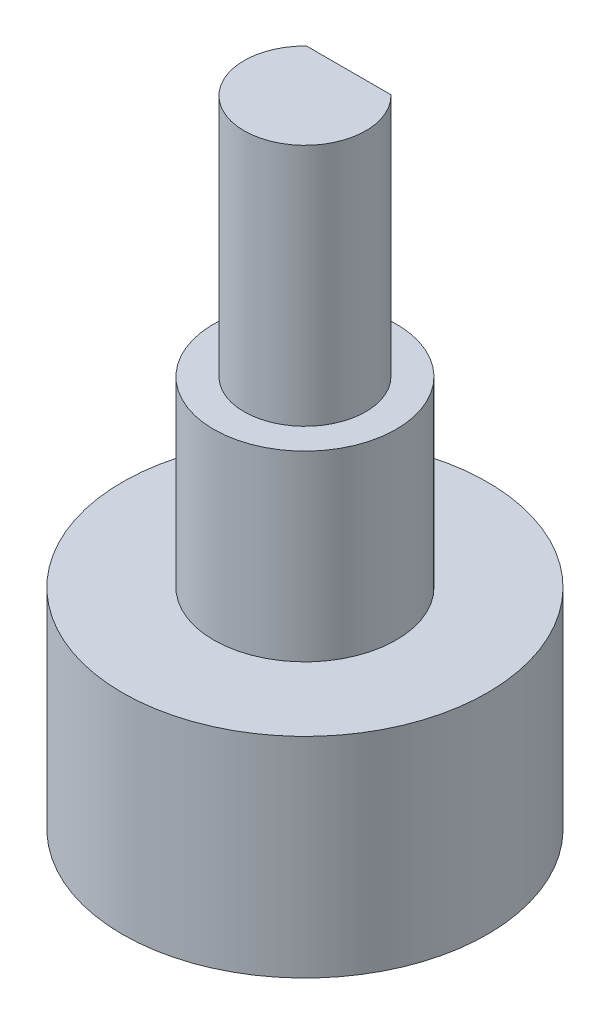
ISO-10303-21;
HEADER;
FILE_DESCRIPTION(('STEP AP214'),'2;1');
FILE_NAME('part.step','',(''),(''),'','','');
FILE_SCHEMA(('AUTOMOTIVE_DESIGN { 1 0 10303 214 1 1 1 1 }'));
ENDSEC;
DATA;
#1=APPLICATION_CONTEXT('core data for automotive mechanical design processes');
#2=APPLICATION_PROTOCOL_DEFINITION('international standard','automotive_design',2000,#1);
#3=PRODUCT_CONTEXT('',#1,'mechanical');
#4=PRODUCT('Part','Part','',(#3));
#5=PRODUCT_RELATED_PRODUCT_CATEGORY('part','',(#4));
#6=PRODUCT_DEFINITION_FORMATION('','',#4);
#7=PRODUCT_DEFINITION_CONTEXT('part definition',#1,'design');
#8=PRODUCT_DEFINITION('design','',#6,#7);
#9=PRODUCT_DEFINITION_SHAPE('','',#8);
#10=(LENGTH_UNIT() NAMED_UNIT(*) SI_UNIT(.MILLI.,.METRE.));
#11=(NAMED_UNIT(*) PLANE_ANGLE_UNIT() SI_UNIT($,.RADIAN.));
#12=(NAMED_UNIT(*) SI_UNIT($,.STERADIAN.) SOLID_ANGLE_UNIT());
#13=UNCERTAINTY_MEASURE_WITH_UNIT(LENGTH_MEASURE(1.E-05),#10,'distance_accuracy_value','');
#14=(GEOMETRIC_REPRESENTATION_CONTEXT(3) GLOBAL_UNCERTAINTY_ASSIGNED_CONTEXT((#13)) GLOBAL_UNIT_ASSIGNED_CONTEXT((#10,
#11,#12)) REPRESENTATION_CONTEXT('',''));
#15=CARTESIAN_POINT('',(0.,0.,0.));
#16=DIRECTION('',(0.,0.,1.));
#17=DIRECTION('',(1.,0.,0.));
#18=AXIS2_PLACEMENT_3D('',#15,#16,#17);
#19=CARTESIAN_POINT('',(0.,20.447,0.));
#20=DIRECTION('',(0.,1.,0.));
#21=DIRECTION('',(0.,0.,1.));
#22=AXIS2_PLACEMENT_3D('',#19,#20,#21);
#23=PLANE('',#22);
#24=CARTESIAN_POINT('',(0.,20.447,0.));
#25=DIRECTION('',(0.,1.,0.));
#26=DIRECTION('',(0.,0.,1.));
#27=AXIS2_PLACEMENT_3D('',#24,#25,#26);
#28=CIRCLE('',#27,4.7625);
#29=CARTESIAN_POINT('',(0.,20.447,4.7625));
#30=VERTEX_POINT('',#29);
#31=EDGE_CURVE('E79',#30,#30,#28,.T.);
#32=ORIENTED_EDGE('',*,*,#31,.T.);
#33=EDGE_LOOP('',(#32));
#34=FACE_BOUND('',#33,.T.);
#35=DIRECTION('',(-1.,0.,0.));
#36=VECTOR('',#35,1.);
#37=CARTESIAN_POINT('',(-2.20336764975798,20.447,-2.286));
#38=LINE('',#37,#36);
#39=CARTESIAN_POINT('',(2.20336764975798,20.447,-2.286));
#40=VERTEX_POINT('',#39);
#41=CARTESIAN_POINT('',(-2.20336764975798,20.447,-2.286));
#42=VERTEX_POINT('',#41);
#43=EDGE_CURVE('E63',#40,#42,#38,.T.);
#44=ORIENTED_EDGE('',*,*,#43,.F.);
#45=CARTESIAN_POINT('',(0.,20.447,0.));
#46=DIRECTION('',(0.,1.,0.));
#47=DIRECTION('',(0.,0.,1.));
#48=AXIS2_PLACEMENT_3D('',#45,#46,#47);
#49=CIRCLE('',#48,3.175);
#50=EDGE_CURVE('E48',#42,#40,#49,.T.);
#51=ORIENTED_EDGE('',*,*,#50,.F.);
#52=EDGE_LOOP('',(#44,#51));
#53=FACE_BOUND('',#52,.T.);
#54=ADVANCED_FACE('F33',(#34,#53),#23,.T.);
#55=CARTESIAN_POINT('',(0.,10.922,0.));
#56=DIRECTION('',(0.,-1.,0.));
#57=DIRECTION('',(0.,0.,-1.));
#58=AXIS2_PLACEMENT_3D('',#55,#56,#57);
#59=CYLINDRICAL_SURFACE('',#58,9.525);
#60=CARTESIAN_POINT('',(0.,10.922,0.));
#61=DIRECTION('',(0.,1.,0.));
#62=DIRECTION('',(0.,0.,1.));
#63=AXIS2_PLACEMENT_3D('',#60,#61,#62);
#64=CIRCLE('',#63,9.525);
#65=CARTESIAN_POINT('',(0.,10.922,9.525));
#66=VERTEX_POINT('',#65);
#67=EDGE_CURVE('E11',#66,#66,#64,.T.);
#68=ORIENTED_EDGE('',*,*,#67,.F.);
#69=EDGE_LOOP('',(#68));
#70=FACE_BOUND('',#69,.T.);
#71=CARTESIAN_POINT('',(0.,0.,0.));
#72=DIRECTION('',(0.,1.,0.));
#73=DIRECTION('',(0.,0.,1.));
#74=AXIS2_PLACEMENT_3D('',#71,#72,#73);
#75=CIRCLE('',#74,9.525);
#76=CARTESIAN_POINT('',(0.,0.,9.525));
#77=VERTEX_POINT('',#76);
#78=EDGE_CURVE('E37',#77,#77,#75,.T.);
#79=ORIENTED_EDGE('',*,*,#78,.T.);
#80=EDGE_LOOP('',(#79));
#81=FACE_BOUND('',#80,.T.);
#82=ADVANCED_FACE('F35',(#70,#81),#59,.T.);
#83=CARTESIAN_POINT('',(0.,10.922,0.));
#84=DIRECTION('',(0.,1.,0.));
#85=DIRECTION('',(0.,0.,1.));
#86=AXIS2_PLACEMENT_3D('',#83,#84,#85);
#87=PLANE('',#86);
#88=CARTESIAN_POINT('',(0.,10.922,0.));
#89=DIRECTION('',(0.,1.,0.));
#90=DIRECTION('',(0.,0.,1.));
#91=AXIS2_PLACEMENT_3D('',#88,#89,#90);
#92=CIRCLE('',#91,4.7625);
#93=CARTESIAN_POINT('',(0.,10.922,4.7625));
#94=VERTEX_POINT('',#93);
#95=EDGE_CURVE('E78',#94,#94,#92,.T.);
#96=ORIENTED_EDGE('',*,*,#95,.F.);
#97=EDGE_LOOP('',(#96));
#98=FACE_BOUND('',#97,.T.);
#99=ORIENTED_EDGE('',*,*,#67,.T.);
#100=EDGE_LOOP('',(#99));
#101=FACE_BOUND('',#100,.T.);
#102=ADVANCED_FACE('F87',(#98,#101),#87,.T.);
#103=CARTESIAN_POINT('',(0.,0.,0.));
#104=DIRECTION('',(0.,1.,0.));
#105=DIRECTION('',(0.,0.,1.));
#106=AXIS2_PLACEMENT_3D('',#103,#104,#105);
#107=PLANE('',#106);
#108=ORIENTED_EDGE('',*,*,#78,.F.);
#109=EDGE_LOOP('',(#108));
#110=FACE_BOUND('',#109,.T.);
#111=ADVANCED_FACE('F90',(#110),#107,.F.);
#112=CARTESIAN_POINT('',(0.,20.447,0.));
#113=DIRECTION('',(0.,-1.,0.));
#114=DIRECTION('',(0.,0.,-1.));
#115=AXIS2_PLACEMENT_3D('',#112,#113,#114);
#116=CYLINDRICAL_SURFACE('',#115,4.7625);
#117=ORIENTED_EDGE('',*,*,#31,.F.);
#118=EDGE_LOOP('',(#117));
#119=FACE_BOUND('',#118,.T.);
#120=ORIENTED_EDGE('',*,*,#95,.T.);
#121=EDGE_LOOP('',(#120));
#122=FACE_BOUND('',#121,.T.);
#123=ADVANCED_FACE('F85',(#119,#122),#116,.T.);
#124=CARTESIAN_POINT('',(0.,33.147,0.));
#125=DIRECTION('',(0.,-1.,0.));
#126=DIRECTION('',(0.,0.,-1.));
#127=AXIS2_PLACEMENT_3D('',#124,#125,#126);
#128=CYLINDRICAL_SURFACE('',#127,3.175);
#129=ORIENTED_EDGE('',*,*,#50,.T.);
#130=DIRECTION('',(0.,-1.,0.));
#131=VECTOR('',#130,1.);
#132=CARTESIAN_POINT('',(2.20336764975798,33.147,-2.286));
#133=LINE('',#132,#131);
#134=CARTESIAN_POINT('',(2.20336764975798,33.147,-2.286));
#135=VERTEX_POINT('',#134);
#136=EDGE_CURVE('E67',#135,#40,#133,.T.);
#137=ORIENTED_EDGE('',*,*,#136,.F.);
#138=CARTESIAN_POINT('',(0.,33.147,0.));
#139=DIRECTION('',(0.,1.,0.));
#140=DIRECTION('',(0.,0.,1.));
#141=AXIS2_PLACEMENT_3D('',#138,#139,#140);
#142=CIRCLE('',#141,3.175);
#143=CARTESIAN_POINT('',(-2.20336764975798,33.147,-2.286));
#144=VERTEX_POINT('',#143);
#145=EDGE_CURVE('E69',#144,#135,#142,.T.);
#146=ORIENTED_EDGE('',*,*,#145,.F.);
#147=DIRECTION('',(0.,-1.,0.));
#148=VECTOR('',#147,1.);
#149=CARTESIAN_POINT('',(-2.20336764975798,33.147,-2.286));
#150=LINE('',#149,#148);
#151=EDGE_CURVE('E65',#144,#42,#150,.T.);
#152=ORIENTED_EDGE('',*,*,#151,.T.);
#153=EDGE_LOOP('',(#129,#137,#146,#152));
#154=FACE_BOUND('',#153,.T.);
#155=ADVANCED_FACE('F71',(#154),#128,.T.);
#156=CARTESIAN_POINT('',(-2.20336764975798,33.147,-2.286));
#157=DIRECTION('',(0.,0.,1.));
#158=DIRECTION('',(1.,0.,0.));
#159=AXIS2_PLACEMENT_3D('',#156,#157,#158);
#160=PLANE('',#159);
#161=ORIENTED_EDGE('',*,*,#43,.T.);
#162=ORIENTED_EDGE('',*,*,#151,.F.);
#163=DIRECTION('',(-1.,0.,0.));
#164=VECTOR('',#163,1.);
#165=CARTESIAN_POINT('',(-2.20336764975798,33.147,-2.286));
#166=LINE('',#165,#164);
#167=EDGE_CURVE('E56',#135,#144,#166,.T.);
#168=ORIENTED_EDGE('',*,*,#167,.F.);
#169=ORIENTED_EDGE('',*,*,#136,.T.);
#170=EDGE_LOOP('',(#161,#162,#168,#169));
#171=FACE_BOUND('',#170,.T.);
#172=ADVANCED_FACE('F64',(#171),#160,.F.);
#173=CARTESIAN_POINT('',(0.,33.147,0.));
#174=DIRECTION('',(0.,1.,0.));
#175=DIRECTION('',(0.,0.,1.));
#176=AXIS2_PLACEMENT_3D('',#173,#174,#175);
#177=PLANE('',#176);
#178=ORIENTED_EDGE('',*,*,#145,.T.);
#179=ORIENTED_EDGE('',*,*,#167,.T.);
#180=EDGE_LOOP('',(#178,#179));
#181=FACE_BOUND('',#180,.T.);
#182=ADVANCED_FACE('F115',(#181),#177,.T.);
#183=CLOSED_SHELL('',(#54,#82,#102,#111,#123,#155,#172,#182));
#184=MANIFOLD_SOLID_BREP('B2',#183);
#185=ADVANCED_BREP_SHAPE_REPRESENTATION('',(#18,#184),#14);
#186=SHAPE_DEFINITION_REPRESENTATION(#9,#185);
ENDSEC;
END-ISO-10303-21;
